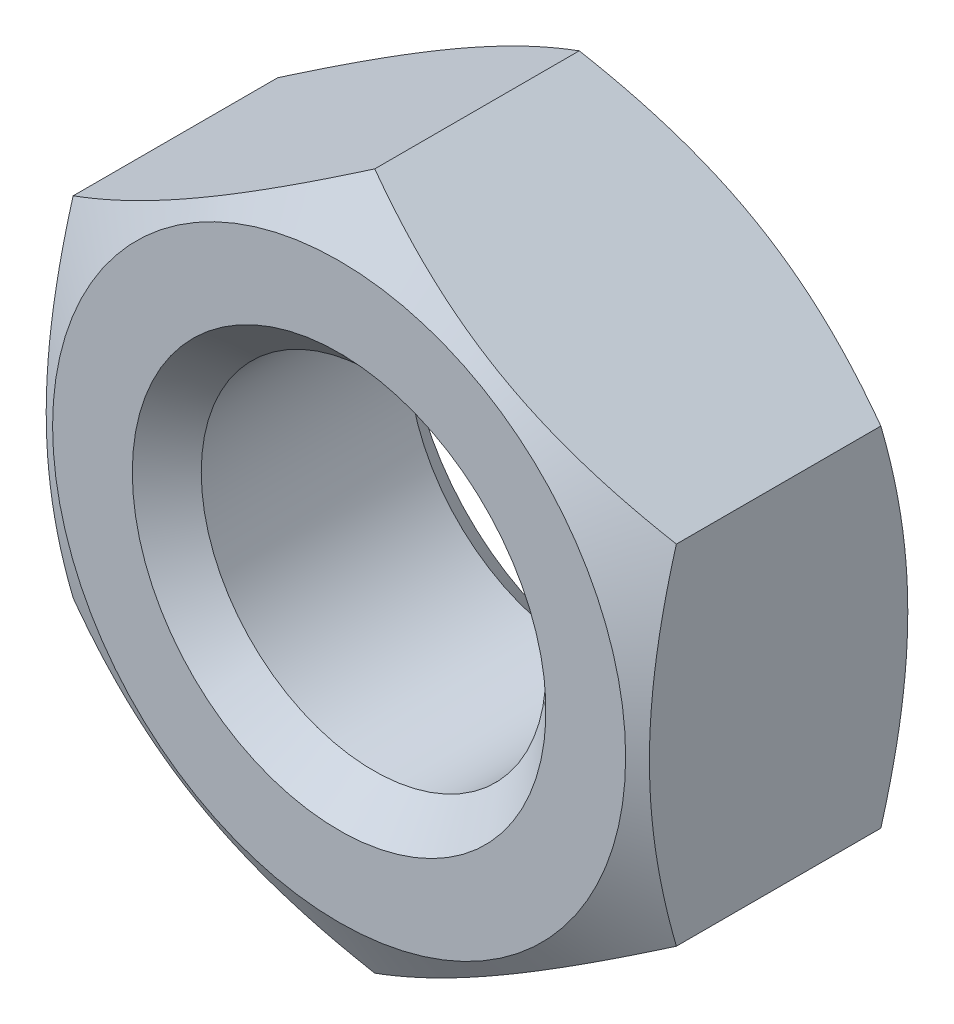
ISO-10303-21;
HEADER;
FILE_DESCRIPTION(('STEP AP214'),'2;1');
FILE_NAME('part.step','',(''),(''),'','','');
FILE_SCHEMA(('AUTOMOTIVE_DESIGN { 1 0 10303 214 1 1 1 1 }'));
ENDSEC;
DATA;
#1=APPLICATION_CONTEXT('core data for automotive mechanical design processes');
#2=APPLICATION_PROTOCOL_DEFINITION('international standard','automotive_design',2000,#1);
#3=PRODUCT_CONTEXT('',#1,'mechanical');
#4=PRODUCT('Part','Part','',(#3));
#5=PRODUCT_RELATED_PRODUCT_CATEGORY('part','',(#4));
#6=PRODUCT_DEFINITION_FORMATION('','',#4);
#7=PRODUCT_DEFINITION_CONTEXT('part definition',#1,'design');
#8=PRODUCT_DEFINITION('design','',#6,#7);
#9=PRODUCT_DEFINITION_SHAPE('','',#8);
#10=(LENGTH_UNIT() NAMED_UNIT(*) SI_UNIT(.MILLI.,.METRE.));
#11=(NAMED_UNIT(*) PLANE_ANGLE_UNIT() SI_UNIT($,.RADIAN.));
#12=(NAMED_UNIT(*) SI_UNIT($,.STERADIAN.) SOLID_ANGLE_UNIT());
#13=UNCERTAINTY_MEASURE_WITH_UNIT(LENGTH_MEASURE(1.E-05),#10,'distance_accuracy_value','');
#14=(GEOMETRIC_REPRESENTATION_CONTEXT(3) GLOBAL_UNCERTAINTY_ASSIGNED_CONTEXT((#13)) GLOBAL_UNIT_ASSIGNED_CONTEXT((#10,
#11,#12)) REPRESENTATION_CONTEXT('',''));
#15=CARTESIAN_POINT('',(0.,0.,0.));
#16=DIRECTION('',(0.,0.,1.));
#17=DIRECTION('',(1.,0.,0.));
#18=AXIS2_PLACEMENT_3D('',#15,#16,#17);
#19=CARTESIAN_POINT('',(0.,0.,0.));
#20=DIRECTION('',(0.,0.,-1.));
#21=DIRECTION('',(-0.999999999999908,0.,0.));
#22=AXIS2_PLACEMENT_3D('',#19,#20,#21);
#23=PLANE('',#22);
#24=CARTESIAN_POINT('',(0.,0.,0.));
#25=DIRECTION('',(0.,0.,-1.));
#26=DIRECTION('',(-0.999999999999908,0.,0.));
#27=AXIS2_PLACEMENT_3D('',#24,#25,#26);
#28=CIRCLE('',#27,2.4);
#29=CARTESIAN_POINT('',(-2.39999999999978,0.,0.));
#30=VERTEX_POINT('',#29);
#31=EDGE_CURVE('E136',#30,#30,#28,.T.);
#32=ORIENTED_EDGE('',*,*,#31,.T.);
#33=EDGE_LOOP('',(#32));
#34=FACE_BOUND('',#33,.T.);
#35=CARTESIAN_POINT('',(0.,0.,0.));
#36=DIRECTION('',(0.,0.,1.));
#37=DIRECTION('',(0.999999999999908,0.,0.));
#38=AXIS2_PLACEMENT_3D('',#35,#36,#37);
#39=CIRCLE('',#38,3.325);
#40=CARTESIAN_POINT('',(3.32499999999969,0.,0.));
#41=VERTEX_POINT('',#40);
#42=EDGE_CURVE('E257',#41,#41,#39,.T.);
#43=ORIENTED_EDGE('',*,*,#42,.T.);
#44=EDGE_LOOP('',(#43));
#45=FACE_BOUND('',#44,.T.);
#46=ADVANCED_FACE('F49',(#34,#45),#23,.F.);
#47=CARTESIAN_POINT('',(0.,8.18789480661053E-13,-3.19999999999997));
#48=DIRECTION('',(0.,0.,1.));
#49=DIRECTION('',(0.999999999999908,0.,0.));
#50=AXIS2_PLACEMENT_3D('',#47,#48,#49);
#51=PLANE('',#50);
#52=CARTESIAN_POINT('',(0.,8.18789480661053E-13,-3.19999999999997));
#53=DIRECTION('',(0.,0.,1.));
#54=DIRECTION('',(0.999999999999908,0.,0.));
#55=AXIS2_PLACEMENT_3D('',#52,#53,#54);
#56=CIRCLE('',#55,2.4);
#57=CARTESIAN_POINT('',(2.39999999999978,8.18789480661053E-13,-3.19999999999997));
#58=VERTEX_POINT('',#57);
#59=EDGE_CURVE('E14',#58,#58,#56,.T.);
#60=ORIENTED_EDGE('',*,*,#59,.T.);
#61=EDGE_LOOP('',(#60));
#62=FACE_BOUND('',#61,.T.);
#63=CARTESIAN_POINT('',(0.,8.18789480661053E-13,-3.19999999999997));
#64=DIRECTION('',(0.,0.,1.));
#65=DIRECTION('',(0.999999999999908,0.,0.));
#66=AXIS2_PLACEMENT_3D('',#63,#64,#65);
#67=CIRCLE('',#66,3.325);
#68=CARTESIAN_POINT('',(3.32499999999969,8.18789480661053E-13,-3.19999999999997));
#69=VERTEX_POINT('',#68);
#70=EDGE_CURVE('E256',#69,#69,#67,.T.);
#71=ORIENTED_EDGE('',*,*,#70,.F.);
#72=EDGE_LOOP('',(#71));
#73=FACE_BOUND('',#72,.T.);
#74=ADVANCED_FACE('F222',(#62,#73),#51,.F.);
#75=CARTESIAN_POINT('',(0.,8.18789480661053E-13,-3.19999999999997));
#76=DIRECTION('',(0.,0.,1.));
#77=DIRECTION('',(0.999999999999908,0.,0.));
#78=AXIS2_PLACEMENT_3D('',#75,#76,#77);
#79=CYLINDRICAL_SURFACE('',#78,2.);
#80=CARTESIAN_POINT('',(0.,-1.22124532708767E-12,-0.399999999999998));
#81=DIRECTION('',(0.,0.,-1.));
#82=DIRECTION('',(-0.999999999999908,0.,0.));
#83=AXIS2_PLACEMENT_3D('',#80,#81,#82);
#84=CIRCLE('',#83,2.);
#85=CARTESIAN_POINT('',(-1.99999999999982,-1.22124532708767E-12,-0.399999999999998));
#86=VERTEX_POINT('',#85);
#87=EDGE_CURVE('E57',#86,#86,#84,.F.);
#88=ORIENTED_EDGE('',*,*,#87,.T.);
#89=EDGE_LOOP('',(#88));
#90=FACE_BOUND('',#89,.T.);
#91=CARTESIAN_POINT('',(0.,6.10622663543836E-13,-2.79999999999998));
#92=DIRECTION('',(0.,0.,1.));
#93=DIRECTION('',(0.999999999999908,0.,0.));
#94=AXIS2_PLACEMENT_3D('',#91,#92,#93);
#95=CIRCLE('',#94,2.);
#96=CARTESIAN_POINT('',(1.99999999999982,6.10622663543836E-13,-2.79999999999998));
#97=VERTEX_POINT('',#96);
#98=EDGE_CURVE('E248',#97,#97,#95,.F.);
#99=ORIENTED_EDGE('',*,*,#98,.T.);
#100=EDGE_LOOP('',(#99));
#101=FACE_BOUND('',#100,.T.);
#102=ADVANCED_FACE('F219',(#90,#101),#79,.F.);
#103=CARTESIAN_POINT('',(0.,6.10622663543836E-13,-2.78635631172215));
#104=DIRECTION('',(0.,0.,1.));
#105=DIRECTION('',(0.999999999999908,0.,0.));
#106=AXIS2_PLACEMENT_3D('',#103,#104,#105);
#107=CONICAL_SURFACE('',#106,4.04145188432738,1.0471975511966);
#108=ORIENTED_EDGE('',*,*,#70,.T.);
#109=EDGE_LOOP('',(#108));
#110=FACE_BOUND('',#109,.T.);
#111=CARTESIAN_POINT('',(-0.000200000000005751,-4.04156735438062,-2.78628964219841));
#112=CARTESIAN_POINT('',(0.153607178452216,-3.95276673849745,-2.83757791390199));
#113=CARTESIAN_POINT('',(0.308742010834124,-3.86319960126091,-2.88422274907586));
#114=CARTESIAN_POINT('',(0.621698006576462,-3.68251437287448,-2.96564182735878));
#115=CARTESIAN_POINT('',(0.779524730787225,-3.59139307116614,-3.00038726730756));
#116=CARTESIAN_POINT('',(1.09322221037986,-3.41027974687918,-3.05447367570928));
#117=CARTESIAN_POINT('',(1.24904469916038,-3.32031559103583,-3.07417461663175));
#118=CARTESIAN_POINT('',(1.56142288720519,-3.13996396007946,-3.09769357015488));
#119=CARTESIAN_POINT('',(1.71797745103422,-3.04957714051028,-3.10153105834656));
#120=CARTESIAN_POINT('',(2.01050921992096,-2.88068384499694,-3.09354840101514));
#121=CARTESIAN_POINT('',(2.14653021245773,-2.80215208834006,-3.08368826882252));
#122=CARTESIAN_POINT('',(2.41768602028871,-2.64560020969628,-3.05243723599271));
#123=CARTESIAN_POINT('',(2.55281989768444,-2.56758062920532,-3.03103565960631));
#124=CARTESIAN_POINT('',(2.82453479240495,-2.41070596159563,-2.97753329501153));
#125=CARTESIAN_POINT('',(2.96108141927808,-2.33187072981343,-2.94520570844704));
#126=CARTESIAN_POINT('',(3.23213809294428,-2.1753760863067,-2.87183476908406));
#127=CARTESIAN_POINT('',(3.36665161246837,-2.09771466959999,-2.8308086563221));
#128=CARTESIAN_POINT('',(3.50020000000001,-2.02061047210925,-2.7862896421984));
#129=B_SPLINE_CURVE_WITH_KNOTS('',3,(#111,#112,#113,#114,#115,#116,#117,#118,#119,#120,#121,
#122,#123,#124,#125,#126,#127,#128),.UNSPECIFIED.,.F.,.F.,(4,2,2,2,2,2,2,2,4),(0.,
0.554793832886324,1.11092123814996,1.65328467083234,2.19498204478421,2.66665130850877,
3.13875761298283,3.62133612600526,4.10296698719206),.UNSPECIFIED.);
#130=CARTESIAN_POINT('',(0.,-4.04145188432678,-2.78635631172214));
#131=VERTEX_POINT('',#130);
#132=CARTESIAN_POINT('',(3.5,-2.02072594216308,-2.78635631172212));
#133=VERTEX_POINT('',#132);
#134=EDGE_CURVE('E260',#131,#133,#129,.T.);
#135=ORIENTED_EDGE('',*,*,#134,.F.);
#136=CARTESIAN_POINT('',(-3.50020000000001,-2.02061047210923,-2.7862896421984));
#137=CARTESIAN_POINT('',(-3.34639282154764,-2.10941108799218,-2.83757791390164));
#138=CARTESIAN_POINT('',(-3.19125798916569,-2.19897822522862,-2.88422274907545));
#139=CARTESIAN_POINT('',(-2.87830199342331,-2.37966345361501,-2.96564182735838));
#140=CARTESIAN_POINT('',(-2.72047526921254,-2.47078475532339,-3.00038726730722));
#141=CARTESIAN_POINT('',(-2.40677778961989,-2.65189807961036,-3.05447367570877));
#142=CARTESIAN_POINT('',(-2.25095530083936,-2.74186223545367,-3.07417461663101));
#143=CARTESIAN_POINT('',(-1.93857711279463,-2.92221386641008,-3.09769357015472));
#144=CARTESIAN_POINT('',(-1.7820225489657,-3.01260068597933,-3.1015310583472));
#145=CARTESIAN_POINT('',(-1.48949078007904,-3.18149398149261,-3.09354840101567));
#146=CARTESIAN_POINT('',(-1.35346978754226,-3.26002573814937,-3.08368826882234));
#147=CARTESIAN_POINT('',(-1.08231397971128,-3.41657761679308,-3.05243723599203));
#148=CARTESIAN_POINT('',(-0.947180102315549,-3.49459719728408,-3.03103565960582));
#149=CARTESIAN_POINT('',(-0.675465207594987,-3.6514718648938,-2.97753329501119));
#150=CARTESIAN_POINT('',(-0.538918580721815,-3.73030709667599,-2.94520570844663));
#151=CARTESIAN_POINT('',(-0.267861907055606,-3.8868017401828,-2.87183476908366));
#152=CARTESIAN_POINT('',(-0.133348387531548,-3.96446315688961,-2.83080865632177));
#153=CARTESIAN_POINT('',(0.000200000000005751,-4.04156735438062,-2.78628964219841));
#154=B_SPLINE_CURVE_WITH_KNOTS('',3,(#136,#137,#138,#139,#140,#141,#142,#143,#144,#145,#146,
#147,#148,#149,#150,#151,#152,#153),.UNSPECIFIED.,.F.,.F.,(4,2,2,2,2,2,2,2,4),(0.,
0.554793832886204,1.11092123814993,1.65328467083227,2.19498204478402,2.66665130850853,
3.13875761298261,3.62133612600516,4.10296698719193),.UNSPECIFIED.);
#155=CARTESIAN_POINT('',(-3.5,-2.02072594216307,-2.78635631172212));
#156=VERTEX_POINT('',#155);
#157=EDGE_CURVE('E205',#156,#131,#154,.T.);
#158=ORIENTED_EDGE('',*,*,#157,.F.);
#159=CARTESIAN_POINT('',(-3.5,-5.34526181714487,-1.43088568831283));
#160=CARTESIAN_POINT('',(-3.5,-5.19170051779117,-1.50503672966403));
#161=CARTESIAN_POINT('',(-3.5,-5.03777455935829,-1.57844634407758));
#162=CARTESIAN_POINT('',(-3.5,-4.72899608100103,-1.72335871364681));
#163=CARTESIAN_POINT('',(-3.5,-4.57414340475472,-1.79486113531656));
#164=CARTESIAN_POINT('',(-3.5,-4.2624708097439,-1.93591485469222));
#165=CARTESIAN_POINT('',(-3.5,-4.10564469538528,-2.00545251235748));
#166=CARTESIAN_POINT('',(-3.5,-3.79069830686184,-2.14152077221436));
#167=CARTESIAN_POINT('',(-3.5,-3.63257810118923,-2.20805153235156));
#168=CARTESIAN_POINT('',(-3.5,-3.31289445808477,-2.33806896187004));
#169=CARTESIAN_POINT('',(-3.5,-3.1513124255715,-2.40151016229672));
#170=CARTESIAN_POINT('',(-3.5,-2.8262375114074,-2.52338880679866));
#171=CARTESIAN_POINT('',(-3.5,-2.66274441881498,-2.58182569245878));
#172=CARTESIAN_POINT('',(-3.5,-2.3339277773035,-2.69211528383048));
#173=CARTESIAN_POINT('',(-3.5,-2.16860901385356,-2.74398211033475));
#174=CARTESIAN_POINT('',(-3.5,-1.8356219930784,-2.83943806104316));
#175=CARTESIAN_POINT('',(-3.5,-1.66795450109762,-2.88302981730834));
#176=CARTESIAN_POINT('',(-3.5,-1.33014983841182,-2.95981183318618));
#177=CARTESIAN_POINT('',(-3.5,-1.16001185355535,-2.99299857850902));
#178=CARTESIAN_POINT('',(-3.5,-0.817700379598249,-3.04672415153755));
#179=CARTESIAN_POINT('',(-3.5,-0.645526886105654,-3.06726295194796));
#180=CARTESIAN_POINT('',(-3.5,-0.301125491851443,-3.09387533047803));
#181=CARTESIAN_POINT('',(-3.5,-0.128904735017056,-3.10003901706232));
#182=CARTESIAN_POINT('',(-3.5,0.21539302145167,-3.09757992160363));
#183=CARTESIAN_POINT('',(-3.5,0.387470046531829,-3.08896090611416));
#184=CARTESIAN_POINT('',(-3.5,0.681759290685613,-3.06218285983281));
#185=CARTESIAN_POINT('',(-3.5,0.804297096459646,-3.04741535990064));
#186=CARTESIAN_POINT('',(-3.5,1.04841668941679,-3.01135199831462));
#187=CARTESIAN_POINT('',(-3.5,1.16999832090341,-2.99005509514569));
#188=CARTESIAN_POINT('',(-3.5,1.53321493371372,-2.91748915601702));
#189=CARTESIAN_POINT('',(-3.5,1.77313647937591,-2.85756389301242));
#190=CARTESIAN_POINT('',(-3.5,2.13211518992131,-2.75432847208893));
#191=CARTESIAN_POINT('',(-3.5,2.25304646048423,-2.71717057420928));
#192=CARTESIAN_POINT('',(-3.5,2.49364645990928,-2.6392078057206));
#193=CARTESIAN_POINT('',(-3.5,2.61331600013571,-2.59840546174206));
#194=CARTESIAN_POINT('',(-3.5,2.85089193463016,-2.51400044501985));
#195=CARTESIAN_POINT('',(-3.5,2.96880446832294,-2.47041487922007));
#196=CARTESIAN_POINT('',(-3.5,3.20371724855571,-2.38070481574431));
#197=CARTESIAN_POINT('',(-3.5,3.32071709950621,-2.3345792801404));
#198=CARTESIAN_POINT('',(-3.5,3.43729521794868,-2.28743504166289));
#199=B_SPLINE_CURVE_WITH_KNOTS('',3,(#159,#160,#161,#162,#163,#164,#165,#166,#167,#168,#169,
#170,#171,#172,#173,#174,#175,#176,#177,#178,#179,#180,#181,#182,#183,#184,#185,#186,#187,#188,
#189,#190,#191,#192,#193,#194,#195,#196,#197,#198),.UNSPECIFIED.,.F.,.F.,(4,2,2,2,2,2,2,2,2,2,2,
2,2,2,2,2,2,2,2,4),(0.,0.511587873670723,1.02326462328226,1.5378940301626,2.05249637322301,
2.57320277380441,3.0939672028071,3.61359266298198,4.1330525673414,4.6526877306207,
5.17232401531018,5.68869417196934,6.20493277981566,6.57502508718526,6.94517645928467,
7.68603507681531,8.0655389522863,8.44478173681004,8.82188382612641,9.19914117399197),.UNSPECIFIED.);
#200=CARTESIAN_POINT('',(-3.5,2.02072594216429,-2.78635631172217));
#201=VERTEX_POINT('',#200);
#202=EDGE_CURVE('E199',#201,#156,#199,.F.);
#203=ORIENTED_EDGE('',*,*,#202,.F.);
#204=CARTESIAN_POINT('',(0.000200000000005751,4.04156735438183,-2.78628964219844));
#205=CARTESIAN_POINT('',(-0.153607178452687,3.95276673849936,-2.83757791390157));
#206=CARTESIAN_POINT('',(-0.308742010834728,3.86319960126305,-2.8842227490753));
#207=CARTESIAN_POINT('',(-0.621698006577133,3.68251437287674,-2.96564182735813));
#208=CARTESIAN_POINT('',(-0.77952473078783,3.59139307116829,-3.00038726730697));
#209=CARTESIAN_POINT('',(-1.09322221038052,3.41027974688143,-3.05447367570859));
#210=CARTESIAN_POINT('',(-1.24904469916115,3.3203155910383,-3.0741746166309));
#211=CARTESIAN_POINT('',(-1.56142288720564,3.13996396008143,-3.09769357015439));
#212=CARTESIAN_POINT('',(-1.71797745103423,3.04957714051156,-3.10153105834658));
#213=CARTESIAN_POINT('',(-2.01050921992097,2.88068384499837,-3.0935484010151));
#214=CARTESIAN_POINT('',(-2.14653021245807,2.80215208834214,-3.08368826882202));
#215=CARTESIAN_POINT('',(-2.41768602028929,2.64560020969881,-3.05243723599191));
#216=CARTESIAN_POINT('',(-2.55281989768492,2.56758062920766,-3.03103565960564));
#217=CARTESIAN_POINT('',(-2.8245347924054,2.41070596159788,-2.97753329501096));
#218=CARTESIAN_POINT('',(-2.96108141927859,2.33187072981578,-2.9452057084464));
#219=CARTESIAN_POINT('',(-3.23213809294474,2.17537608630892,-2.87183476908351));
#220=CARTESIAN_POINT('',(-3.36665161246872,2.09771466960196,-2.8308086563217));
#221=CARTESIAN_POINT('',(-3.50020000000001,2.02061047211045,-2.78628964219844));
#222=B_SPLINE_CURVE_WITH_KNOTS('',3,(#204,#205,#206,#207,#208,#209,#210,#211,#212,#213,#214,
#215,#216,#217,#218,#219,#220,#221),.UNSPECIFIED.,.F.,.F.,(4,2,2,2,2,2,2,2,4),(0.,
0.554793832886193,1.11092123814985,1.6532846708322,2.19498204478398,2.6666513085085,
3.13875761298257,3.62133612600504,4.10296698719177),.UNSPECIFIED.);
#223=CARTESIAN_POINT('',(0.,4.04145188432799,-2.78635631172217));
#224=VERTEX_POINT('',#223);
#225=EDGE_CURVE('E103',#224,#201,#222,.T.);
#226=ORIENTED_EDGE('',*,*,#225,.F.);
#227=CARTESIAN_POINT('',(3.50020000000001,2.02061047211045,-2.78628964219844));
#228=CARTESIAN_POINT('',(3.34639282154758,2.10941108799332,-2.83757791390179));
#229=CARTESIAN_POINT('',(3.19125798916561,2.19897822522975,-2.88422274907556));
#230=CARTESIAN_POINT('',(2.87830199342326,2.3796634536161,-2.9656418273584));
#231=CARTESIAN_POINT('',(2.72047526921254,2.47078475532446,-3.00038726730719));
#232=CARTESIAN_POINT('',(2.40677778961993,2.6518980796114,-3.05447367570891));
#233=CARTESIAN_POINT('',(2.25095530083939,2.74186223545468,-3.07417461663136));
#234=CARTESIAN_POINT('',(1.93857711279466,2.92221386641117,-3.09769357015451));
#235=CARTESIAN_POINT('',(1.78202254896575,3.01260068598051,-3.10153105834623));
#236=CARTESIAN_POINT('',(1.489490780079,3.18149398149381,-3.09354840101481));
#237=CARTESIAN_POINT('',(1.35346978754214,3.26002573815054,-3.08368826882215));
#238=CARTESIAN_POINT('',(1.08231397971109,3.41657761679423,-3.05243723599234));
#239=CARTESIAN_POINT('',(0.947180102315384,3.49459719728524,-3.03103565960595));
#240=CARTESIAN_POINT('',(0.675465207594869,3.65147186489494,-2.97753329501118));
#241=CARTESIAN_POINT('',(0.538918580721722,3.7303070966771,-2.94520570844666));
#242=CARTESIAN_POINT('',(0.267861907055548,3.88680174018391,-2.87183476908376));
#243=CARTESIAN_POINT('',(0.1333483875315,3.96446315689074,-2.83080865632191));
#244=CARTESIAN_POINT('',(-0.000200000000005751,4.04156735438183,-2.78628964219844));
#245=B_SPLINE_CURVE_WITH_KNOTS('',3,(#227,#228,#229,#230,#231,#232,#233,#234,#235,#236,#237,
#238,#239,#240,#241,#242,#243,#244),.UNSPECIFIED.,.F.,.F.,(4,2,2,2,2,2,2,2,4),(0.,
0.554793832886237,1.11092123814981,1.65328467083216,2.19498204478399,2.66665130850856,
3.13875761298265,3.62133612600508,4.10296698719186),.UNSPECIFIED.);
#246=CARTESIAN_POINT('',(3.5,2.02072594216429,-2.78635631172217));
#247=VERTEX_POINT('',#246);
#248=EDGE_CURVE('E100',#247,#224,#245,.T.);
#249=ORIENTED_EDGE('',*,*,#248,.F.);
#250=CARTESIAN_POINT('',(3.5,-5.34526181714545,-1.43088568831283));
#251=CARTESIAN_POINT('',(3.5,-5.19170051779167,-1.50503672966389));
#252=CARTESIAN_POINT('',(3.5,-5.03777455935875,-1.57844634407739));
#253=CARTESIAN_POINT('',(3.5,-4.72899608100144,-1.72335871364659));
#254=CARTESIAN_POINT('',(3.5,-4.57414340475512,-1.79486113531637));
#255=CARTESIAN_POINT('',(3.5,-4.26247080974428,-1.93591485469206));
#256=CARTESIAN_POINT('',(3.5,-4.10564469538564,-2.00545251235732));
#257=CARTESIAN_POINT('',(3.5,-3.79069830686216,-2.14152077221422));
#258=CARTESIAN_POINT('',(3.5,-3.63257810118954,-2.20805153235143));
#259=CARTESIAN_POINT('',(3.5,-3.31289445808505,-2.33806896186993));
#260=CARTESIAN_POINT('',(3.5,-3.15131242557175,-2.40151016229662));
#261=CARTESIAN_POINT('',(3.5,-2.8262375114076,-2.52338880679859));
#262=CARTESIAN_POINT('',(3.5,-2.66274441881516,-2.58182569245872));
#263=CARTESIAN_POINT('',(3.5,-2.33392777730364,-2.69211528383044));
#264=CARTESIAN_POINT('',(3.5,-2.16860901385367,-2.74398211033472));
#265=CARTESIAN_POINT('',(3.5,-1.83562199307847,-2.83943806104315));
#266=CARTESIAN_POINT('',(3.5,-1.66795450109766,-2.88302981730834));
#267=CARTESIAN_POINT('',(3.5,-1.33014983841185,-2.95981183318618));
#268=CARTESIAN_POINT('',(3.5,-1.16001185355538,-2.99299857850902));
#269=CARTESIAN_POINT('',(3.5,-0.817700379598298,-3.04672415153754));
#270=CARTESIAN_POINT('',(3.5,-0.645526886105713,-3.06726295194795));
#271=CARTESIAN_POINT('',(3.5,-0.301125491851523,-3.09387533047802));
#272=CARTESIAN_POINT('',(3.5,-0.128904735017148,-3.10003901706232));
#273=CARTESIAN_POINT('',(3.5,0.215393021451554,-3.09757992160363));
#274=CARTESIAN_POINT('',(3.5,0.387470046531702,-3.08896090611416));
#275=CARTESIAN_POINT('',(3.5,0.681759290685433,-3.06218285983282));
#276=CARTESIAN_POINT('',(3.5,0.804297096459426,-3.04741535990067));
#277=CARTESIAN_POINT('',(3.5,1.04841668941649,-3.01135199831467));
#278=CARTESIAN_POINT('',(3.5,1.16999832090307,-2.99005509514576));
#279=CARTESIAN_POINT('',(3.5,1.53321493371326,-2.91748915601712));
#280=CARTESIAN_POINT('',(3.5,1.77313647937538,-2.85756389301255));
#281=CARTESIAN_POINT('',(3.5,2.13211518992066,-2.75432847208913));
#282=CARTESIAN_POINT('',(3.5,2.25304646048355,-2.7171705742095));
#283=CARTESIAN_POINT('',(3.5,2.49364645990852,-2.63920780572085));
#284=CARTESIAN_POINT('',(3.5,2.61331600013491,-2.59840546174233));
#285=CARTESIAN_POINT('',(3.5,2.8508919346293,-2.51400044502017));
#286=CARTESIAN_POINT('',(3.5,2.96880446832207,-2.47041487922044));
#287=CARTESIAN_POINT('',(3.5,3.20371724855473,-2.38070481574464));
#288=CARTESIAN_POINT('',(3.5,3.32071709950516,-2.33457928014065));
#289=CARTESIAN_POINT('',(3.5,3.4372952179475,-2.28743504166289));
#290=B_SPLINE_CURVE_WITH_KNOTS('',3,(#250,#251,#252,#253,#254,#255,#256,#257,#258,#259,#260,
#261,#262,#263,#264,#265,#266,#267,#268,#269,#270,#271,#272,#273,#274,#275,#276,#277,#278,#279,
#280,#281,#282,#283,#284,#285,#286,#287,#288,#289),.UNSPECIFIED.,.F.,.F.,(4,2,2,2,2,2,2,2,2,2,2,
2,2,2,2,2,2,2,2,4),(0.,0.51158787367077,1.02326462328236,1.53789403016275,2.05249637322322,
2.57320277380469,3.09396720280746,3.61359266298242,4.13305256734192,4.65268773062118,
5.17232401531064,5.68869417196976,6.20493277981605,6.57502508718552,6.94517645928481,
7.6860350768152,8.06553895228607,8.44478173680969,8.82188382612594,9.19914117399139),.UNSPECIFIED.);
#291=EDGE_CURVE('E72',#133,#247,#290,.T.);
#292=ORIENTED_EDGE('',*,*,#291,.F.);
#293=EDGE_LOOP('',(#135,#158,#203,#226,#249,#292));
#294=FACE_BOUND('',#293,.T.);
#295=ADVANCED_FACE('F101',(#110,#294),#107,.T.);
#296=CARTESIAN_POINT('',(0.,-4.0414518843261,-17.4835569799683));
#297=DIRECTION('',(0.499999999999954,-0.866025403784346,0.));
#298=DIRECTION('',(0.866025403784346,0.499999999999954,0.));
#299=AXIS2_PLACEMENT_3D('',#296,#297,#298);
#300=PLANE('',#299);
#301=DIRECTION('',(0.,0.,1.));
#302=VECTOR('',#301,1.);
#303=CARTESIAN_POINT('',(3.5,-2.02072594216302,-17.4835569799684));
#304=LINE('',#303,#302);
#305=CARTESIAN_POINT('',(3.5,-2.02072594216492,-0.413643688277738));
#306=VERTEX_POINT('',#305);
#307=EDGE_CURVE('E116',#133,#306,#304,.T.);
#308=ORIENTED_EDGE('',*,*,#307,.T.);
#309=CARTESIAN_POINT('',(3.50020000000001,-2.02061047211108,-0.413710357801466));
#310=CARTESIAN_POINT('',(3.34639282154686,-2.10941108799251,-0.362422086097561));
#311=CARTESIAN_POINT('',(3.19125798916465,-2.19897822522848,-0.31577725092367));
#312=CARTESIAN_POINT('',(2.87830199342223,-2.37966345361455,-0.234358172640841));
#313=CARTESIAN_POINT('',(2.72047526921169,-2.47078475532309,-0.199612732692173));
#314=CARTESIAN_POINT('',(2.40677778961905,-2.65189807960981,-0.145526324290252));
#315=CARTESIAN_POINT('',(2.25095530083832,-2.74186223545273,-0.125825383367499));
#316=CARTESIAN_POINT('',(1.93857711279409,-2.9222138664101,-0.102306429845186));
#317=CARTESIAN_POINT('',(1.78202254896586,-3.01260068598069,-0.0984689416546137));
#318=CARTESIAN_POINT('',(1.48949078007888,-3.18149398149388,-0.106451598985886));
#319=CARTESIAN_POINT('',(1.3534697875413,-3.26002573814956,-0.11631173117755));
#320=CARTESIAN_POINT('',(1.08231397970971,-3.41657761679252,-0.14756276400667));
#321=CARTESIAN_POINT('',(0.947180102314188,-3.49459719728386,-0.168964340393353));
#322=CARTESIAN_POINT('',(0.675465207593765,-3.65147186489369,-0.222466704988375));
#323=CARTESIAN_POINT('',(0.538918580720521,-3.73030709667564,-0.25479429155283));
#324=CARTESIAN_POINT('',(0.267861907054495,-3.88680174018271,-0.328165230915729));
#325=CARTESIAN_POINT('',(0.133348387530693,-3.96446315689,-0.369191343677651));
#326=CARTESIAN_POINT('',(-0.000200000000005751,-4.04156735438244,-0.413710357801466));
#327=B_SPLINE_CURVE_WITH_KNOTS('',3,(#309,#310,#311,#312,#313,#314,#315,#316,#317,#318,#319,
#320,#321,#322,#323,#324,#325,#326),.UNSPECIFIED.,.F.,.F.,(4,2,2,2,2,2,2,2,4),(0.,
0.554793832886304,1.11092123814965,1.65328467083194,2.19498204478387,2.66665130850861,
3.13875761298275,3.62133612600512,4.10296698719203),.UNSPECIFIED.);
#328=CARTESIAN_POINT('',(0.,-4.0414518843286,-0.413643688277738));
#329=VERTEX_POINT('',#328);
#330=EDGE_CURVE('E129',#306,#329,#327,.T.);
#331=ORIENTED_EDGE('',*,*,#330,.T.);
#332=DIRECTION('',(0.,0.,1.));
#333=VECTOR('',#332,1.);
#334=CARTESIAN_POINT('',(0.,-4.0414518843261,-17.4835569799683));
#335=LINE('',#334,#333);
#336=EDGE_CURVE('E137',#131,#329,#335,.T.);
#337=ORIENTED_EDGE('',*,*,#336,.F.);
#338=ORIENTED_EDGE('',*,*,#134,.T.);
#339=EDGE_LOOP('',(#308,#331,#337,#338));
#340=FACE_BOUND('',#339,.T.);
#341=ADVANCED_FACE('F139',(#340),#300,.T.);
#342=CARTESIAN_POINT('',(-3.5,-2.02072594216329,-17.4835569799684));
#343=DIRECTION('',(-0.499999999999954,-0.866025403784346,0.));
#344=DIRECTION('',(0.866025403784346,-0.499999999999954,0.));
#345=AXIS2_PLACEMENT_3D('',#342,#343,#344);
#346=PLANE('',#345);
#347=ORIENTED_EDGE('',*,*,#336,.T.);
#348=CARTESIAN_POINT('',(0.000200000000005751,-4.04156735438244,-0.413710357801466));
#349=CARTESIAN_POINT('',(-0.153607178452005,-3.95276673849877,-0.362422086098104));
#350=CARTESIAN_POINT('',(-0.308742010833846,-3.86319960126205,-0.31577725092433));
#351=CARTESIAN_POINT('',(-0.621698006576149,-3.68251437287551,-0.234358172641477));
#352=CARTESIAN_POINT('',(-0.779524730786942,-3.59139307116724,-0.199612732692672));
#353=CARTESIAN_POINT('',(-1.09322221037957,-3.41027974688024,-0.145526324290871));
#354=CARTESIAN_POINT('',(-1.24904469916005,-3.3203155910368,-0.125825383368359));
#355=CARTESIAN_POINT('',(-1.56142288720502,-3.13996396008062,-0.10230642984532));
#356=CARTESIAN_POINT('',(-1.71797745103424,-3.04957714051173,-0.0984689416537765));
#357=CARTESIAN_POINT('',(-2.01050921992097,-2.88068384499834,-0.106451598985148));
#358=CARTESIAN_POINT('',(-2.14653021245757,-2.8021520883412,-0.116311731177628));
#359=CARTESIAN_POINT('',(-2.41768602028842,-2.64560020969724,-0.147562764007306));
#360=CARTESIAN_POINT('',(-2.55281989768417,-2.56758062920637,-0.168964340393731));
#361=CARTESIAN_POINT('',(-2.82453479240466,-2.41070596159673,-0.222466704988505));
#362=CARTESIAN_POINT('',(-2.96108141927772,-2.33187072981448,-0.254794291552977));
#363=CARTESIAN_POINT('',(-3.23213809294394,-2.17537608630788,-0.32816523091589));
#364=CARTESIAN_POINT('',(-3.36665161246811,-2.09771466960134,-0.369191343677806));
#365=CARTESIAN_POINT('',(-3.50020000000001,-2.02061047211108,-0.413710357801466));
#366=B_SPLINE_CURVE_WITH_KNOTS('',3,(#348,#349,#350,#351,#352,#353,#354,#355,#356,#357,#358,
#359,#360,#361,#362,#363,#364,#365),.UNSPECIFIED.,.F.,.F.,(4,2,2,2,2,2,2,2,4),(0.,
0.554793832886348,1.11092123814999,1.65328467083242,2.19498204478435,2.66665130850887,
3.13875761298287,3.6213361260052,4.10296698719191),.UNSPECIFIED.);
#367=CARTESIAN_POINT('',(-3.5,-2.02072594216492,-0.413643688277738));
#368=VERTEX_POINT('',#367);
#369=EDGE_CURVE('E64',#329,#368,#366,.T.);
#370=ORIENTED_EDGE('',*,*,#369,.T.);
#371=DIRECTION('',(0.,0.,1.));
#372=VECTOR('',#371,1.);
#373=CARTESIAN_POINT('',(-3.5,-2.02072594216329,-17.4835569799684));
#374=LINE('',#373,#372);
#375=EDGE_CURVE('E271',#156,#368,#374,.T.);
#376=ORIENTED_EDGE('',*,*,#375,.F.);
#377=ORIENTED_EDGE('',*,*,#157,.T.);
#378=EDGE_LOOP('',(#347,#370,#376,#377));
#379=FACE_BOUND('',#378,.T.);
#380=ADVANCED_FACE('F213',(#379),#346,.T.);
#381=CARTESIAN_POINT('',(-3.5,2.02072594216408,-17.4835569799684));
#382=DIRECTION('',(-0.999999999999908,0.,0.));
#383=DIRECTION('',(0.,-0.999999999999908,0.));
#384=AXIS2_PLACEMENT_3D('',#381,#382,#383);
#385=PLANE('',#384);
#386=ORIENTED_EDGE('',*,*,#375,.T.);
#387=CARTESIAN_POINT('',(-3.5,-5.34526181714602,-1.76911431168768));
#388=CARTESIAN_POINT('',(-3.5,-5.19170051779236,-1.69496327033632));
#389=CARTESIAN_POINT('',(-3.5,-5.03777455935947,-1.62155365592269));
#390=CARTESIAN_POINT('',(-3.5,-4.72899608100217,-1.47664128635338));
#391=CARTESIAN_POINT('',(-3.5,-4.57414340475582,-1.40513886468363));
#392=CARTESIAN_POINT('',(-3.5,-4.26247080974496,-1.26408514530796));
#393=CARTESIAN_POINT('',(-3.5,-4.10564469538635,-1.1945474876427));
#394=CARTESIAN_POINT('',(-3.5,-3.79069830686289,-1.0584792277858));
#395=CARTESIAN_POINT('',(-3.5,-3.63257810119028,-0.991948467648602));
#396=CARTESIAN_POINT('',(-3.5,-3.3128944580858,-0.861931038130102));
#397=CARTESIAN_POINT('',(-3.5,-3.15131242557251,-0.798489837703405));
#398=CARTESIAN_POINT('',(-3.5,-2.82623751140839,-0.676611193201458));
#399=CARTESIAN_POINT('',(-3.5,-2.66274441881595,-0.618174307541358));
#400=CARTESIAN_POINT('',(-3.5,-2.33392777730445,-0.507884716169561));
#401=CARTESIAN_POINT('',(-3.5,-2.16860901385451,-0.456017889665179));
#402=CARTESIAN_POINT('',(-3.5,-1.83562199307921,-0.360561938957003));
#403=CARTESIAN_POINT('',(-3.5,-1.6679545010983,-0.316970182692167));
#404=CARTESIAN_POINT('',(-3.5,-1.33014983841247,-0.240188166814311));
#405=CARTESIAN_POINT('',(-3.5,-1.1600118535561,-0.207001421491101));
#406=CARTESIAN_POINT('',(-3.5,-0.817700379599148,-0.153275848462349));
#407=CARTESIAN_POINT('',(-3.5,-0.64552688610659,-0.13273704805208));
#408=CARTESIAN_POINT('',(-3.5,-0.301125491852459,-0.106124669521939));
#409=CARTESIAN_POINT('',(-3.5,-0.128904735018117,-0.0999609829374305));
#410=CARTESIAN_POINT('',(-3.5,0.215393021450493,-0.102420078396557));
#411=CARTESIAN_POINT('',(-3.5,0.387470046530582,-0.111039093886675));
#412=CARTESIAN_POINT('',(-3.5,0.681759290684307,-0.137817140167774));
#413=CARTESIAN_POINT('',(-3.5,0.804297096458319,-0.15258464009943));
#414=CARTESIAN_POINT('',(-3.5,1.04841668941534,-0.188648001685029));
#415=CARTESIAN_POINT('',(-3.5,1.16999832090186,-0.209944904854045));
#416=CARTESIAN_POINT('',(-3.5,1.53321493371186,-0.282510843982804));
#417=CARTESIAN_POINT('',(-3.5,1.77313647937386,-0.342436106987215));
#418=CARTESIAN_POINT('',(-3.5,2.13211518991895,-0.445671527910502));
#419=CARTESIAN_POINT('',(-3.5,2.25304646048175,-0.482829425790096));
#420=CARTESIAN_POINT('',(-3.5,2.49364645990656,-0.560792194278677));
#421=CARTESIAN_POINT('',(-3.5,2.61331600013287,-0.601594538257177));
#422=CARTESIAN_POINT('',(-3.5,2.85089193462717,-0.685999554979226));
#423=CARTESIAN_POINT('',(-3.5,2.96880446831992,-0.729585120778884));
#424=CARTESIAN_POINT('',(-3.5,3.20371724855245,-0.819295184254759));
#425=CARTESIAN_POINT('',(-3.5,3.32071709950277,-0.865420719858908));
#426=CARTESIAN_POINT('',(-3.5,3.43729521794489,-0.912564958337074));
#427=B_SPLINE_CURVE_WITH_KNOTS('',3,(#387,#388,#389,#390,#391,#392,#393,#394,#395,#396,#397,
#398,#399,#400,#401,#402,#403,#404,#405,#406,#407,#408,#409,#410,#411,#412,#413,#414,#415,#416,
#417,#418,#419,#420,#421,#422,#423,#424,#425,#426),.UNSPECIFIED.,.F.,.F.,(4,2,2,2,2,2,2,2,2,2,2,
2,2,2,2,2,2,2,2,4),(0.,0.511587873670839,1.02326462328248,1.53789403016283,2.05249637322326,
2.57320277380472,3.09396720280744,3.61359266298242,4.13305256734198,4.65268773062118,
5.1723240153105,5.68869417196951,6.20493277981575,6.57502508718512,6.94517645928426,
7.68603507681424,8.06553895228484,8.44478173680822,8.82188382612434,9.19914117398964),.UNSPECIFIED.);
#428=CARTESIAN_POINT('',(-3.5,2.02072594216247,-0.413643688277829));
#429=VERTEX_POINT('',#428);
#430=EDGE_CURVE('E162',#368,#429,#427,.T.);
#431=ORIENTED_EDGE('',*,*,#430,.T.);
#432=DIRECTION('',(0.,0.,1.));
#433=VECTOR('',#432,1.);
#434=CARTESIAN_POINT('',(-3.5,2.02072594216408,-17.4835569799684));
#435=LINE('',#434,#433);
#436=EDGE_CURVE('E123',#201,#429,#435,.T.);
#437=ORIENTED_EDGE('',*,*,#436,.F.);
#438=ORIENTED_EDGE('',*,*,#202,.T.);
#439=EDGE_LOOP('',(#386,#431,#437,#438));
#440=FACE_BOUND('',#439,.T.);
#441=ADVANCED_FACE('F210',(#440),#385,.T.);
#442=CARTESIAN_POINT('',(0.,4.04145188432867,-17.4835569799684));
#443=DIRECTION('',(-0.499999999999954,0.866025403784346,0.));
#444=DIRECTION('',(-0.866025403784346,-0.499999999999954,0.));
#445=AXIS2_PLACEMENT_3D('',#442,#443,#444);
#446=PLANE('',#445);
#447=ORIENTED_EDGE('',*,*,#436,.T.);
#448=CARTESIAN_POINT('',(-3.50020000000001,2.02061047210864,-0.413710357801557));
#449=CARTESIAN_POINT('',(-3.34639282154822,2.10941108799282,-0.362422086098624));
#450=CARTESIAN_POINT('',(-3.19125798916645,2.19897822522969,-0.315777250925008));
#451=CARTESIAN_POINT('',(-2.87830199342419,2.37966345361631,-0.234358172642268));
#452=CARTESIAN_POINT('',(-2.72047526921336,2.47078475532449,-0.199612732693419));
#453=CARTESIAN_POINT('',(-2.40677778962078,2.65189807961157,-0.145526324291688));
#454=CARTESIAN_POINT('',(-2.25095530084038,2.74186223545516,-0.125825383369287));
#455=CARTESIAN_POINT('',(-1.93857711279522,2.92221386641096,-0.102306429846023));
#456=CARTESIAN_POINT('',(-1.78202254896571,3.01260068597931,-0.0984689416541417));
#457=CARTESIAN_POINT('',(-1.48949078007908,3.18149398149275,-0.106451598985562));
#458=CARTESIAN_POINT('',(-1.35346978754277,3.26002573815035,-0.11631173117834));
#459=CARTESIAN_POINT('',(-1.08231397971214,3.41657761679463,-0.147562764008218));
#460=CARTESIAN_POINT('',(-0.947180102316297,3.49459719728536,-0.168964340394546));
#461=CARTESIAN_POINT('',(-0.675465207595776,3.65147186489494,-0.222466704989258));
#462=CARTESIAN_POINT('',(-0.53891858072276,3.73030709667726,-0.25479429155377));
#463=CARTESIAN_POINT('',(-0.267861907056492,3.88680174018378,-0.328165230916591));
#464=CARTESIAN_POINT('',(-0.133348387532221,3.96446315689017,-0.369191343678375));
#465=CARTESIAN_POINT('',(0.000200000000005751,4.04156735437999,-0.413710357801669));
#466=B_SPLINE_CURVE_WITH_KNOTS('',3,(#448,#449,#450,#451,#452,#453,#454,#455,#456,#457,#458,
#459,#460,#461,#462,#463,#464,#465),.UNSPECIFIED.,.F.,.F.,(4,2,2,2,2,2,2,2,4),(0.,
0.554793832886246,1.11092123814989,1.65328467083231,2.19498204478419,2.66665130850865,
3.13875761298265,3.62133612600498,4.10296698719162),.UNSPECIFIED.);
#467=CARTESIAN_POINT('',(0.,4.04145188432616,-0.413643688277948));
#468=VERTEX_POINT('',#467);
#469=EDGE_CURVE('E168',#429,#468,#466,.T.);
#470=ORIENTED_EDGE('',*,*,#469,.T.);
#471=DIRECTION('',(0.,0.,1.));
#472=VECTOR('',#471,1.);
#473=CARTESIAN_POINT('',(0.,4.04145188432867,-17.4835569799684));
#474=LINE('',#473,#472);
#475=EDGE_CURVE('E121',#224,#468,#474,.T.);
#476=ORIENTED_EDGE('',*,*,#475,.F.);
#477=ORIENTED_EDGE('',*,*,#225,.T.);
#478=EDGE_LOOP('',(#447,#470,#476,#477));
#479=FACE_BOUND('',#478,.T.);
#480=ADVANCED_FACE('F184',(#479),#446,.T.);
#481=CARTESIAN_POINT('',(3.5,2.02072594216436,-17.4835569799684));
#482=DIRECTION('',(0.499999999999954,0.866025403784346,0.));
#483=DIRECTION('',(-0.866025403784346,0.499999999999954,0.));
#484=AXIS2_PLACEMENT_3D('',#481,#482,#483);
#485=PLANE('',#484);
#486=ORIENTED_EDGE('',*,*,#475,.T.);
#487=CARTESIAN_POINT('',(-0.000200000000005751,4.04156735437999,-0.413710357801676));
#488=CARTESIAN_POINT('',(0.153607178453007,3.9527667384982,-0.362422086098281));
#489=CARTESIAN_POINT('',(0.308742010835156,3.86319960126212,-0.31577725092454));
#490=CARTESIAN_POINT('',(0.62169800657756,3.682514372876,-0.234358172641783));
#491=CARTESIAN_POINT('',(0.779524730788146,3.59139307116751,-0.19961273269304));
#492=CARTESIAN_POINT('',(1.09322221038077,3.41027974688072,-0.145526324291279));
#493=CARTESIAN_POINT('',(1.24904469916144,3.3203155910377,-0.12582538336875));
#494=CARTESIAN_POINT('',(1.56142288720578,3.1399639600806,-0.102306429845897));
#495=CARTESIAN_POINT('',(1.71797745103419,3.04957714051038,-0.0984689416545571));
#496=CARTESIAN_POINT('',(2.01050921992104,2.88068384499719,-0.106451598985936));
#497=CARTESIAN_POINT('',(2.14653021245839,2.80215208834123,-0.116311731178274));
#498=CARTESIAN_POINT('',(2.41768602028981,2.64560020969807,-0.14756276400786));
#499=CARTESIAN_POINT('',(2.55281989768539,2.56758062920682,-0.168964340394336));
#500=CARTESIAN_POINT('',(2.82453479240586,2.41070596159702,-0.222466704989217));
#501=CARTESIAN_POINT('',(2.96108141927908,2.33187072981501,-0.254794291553745));
#502=CARTESIAN_POINT('',(3.23213809294516,2.17537608630799,-0.328165230916545));
#503=CARTESIAN_POINT('',(3.36665161246904,2.09771466960079,-0.369191343678293));
#504=CARTESIAN_POINT('',(3.50020000000001,2.02061047210864,-0.413710357801557));
#505=B_SPLINE_CURVE_WITH_KNOTS('',3,(#487,#488,#489,#490,#491,#492,#493,#494,#495,#496,#497,
#498,#499,#500,#501,#502,#503,#504),.UNSPECIFIED.,.F.,.F.,(4,2,2,2,2,2,2,2,4),(0.,
0.554793832886164,1.11092123814958,1.65328467083186,2.19498204478368,2.66665130850833,
3.13875761298247,3.62133612600489,4.10296698719171),.UNSPECIFIED.);
#506=CARTESIAN_POINT('',(3.5,2.02072594216247,-0.413643688277829));
#507=VERTEX_POINT('',#506);
#508=EDGE_CURVE('E120',#468,#507,#505,.T.);
#509=ORIENTED_EDGE('',*,*,#508,.T.);
#510=DIRECTION('',(0.,0.,1.));
#511=VECTOR('',#510,1.);
#512=CARTESIAN_POINT('',(3.5,2.02072594216436,-17.4835569799684));
#513=LINE('',#512,#511);
#514=EDGE_CURVE('E114',#247,#507,#513,.T.);
#515=ORIENTED_EDGE('',*,*,#514,.F.);
#516=ORIENTED_EDGE('',*,*,#248,.T.);
#517=EDGE_LOOP('',(#486,#509,#515,#516));
#518=FACE_BOUND('',#517,.T.);
#519=ADVANCED_FACE('F119',(#518),#485,.T.);
#520=CARTESIAN_POINT('',(3.5,-2.02072594216302,-17.4835569799684));
#521=DIRECTION('',(0.999999999999908,0.,0.));
#522=DIRECTION('',(0.,0.999999999999908,0.));
#523=AXIS2_PLACEMENT_3D('',#520,#521,#522);
#524=PLANE('',#523);
#525=ORIENTED_EDGE('',*,*,#514,.T.);
#526=CARTESIAN_POINT('',(3.5,-5.34526181714655,-1.76911431168768));
#527=CARTESIAN_POINT('',(3.5,-5.1917005177928,-1.69496327033645));
#528=CARTESIAN_POINT('',(3.5,-5.03777455935988,-1.62155365592286));
#529=CARTESIAN_POINT('',(3.5,-4.72899608100252,-1.47664128635357));
#530=CARTESIAN_POINT('',(3.5,-4.57414340475616,-1.40513886468379));
#531=CARTESIAN_POINT('',(3.5,-4.26247080974527,-1.2640851453081));
#532=CARTESIAN_POINT('',(3.5,-4.10564469538663,-1.19454748764282));
#533=CARTESIAN_POINT('',(3.5,-3.79069830686314,-1.05847922778591));
#534=CARTESIAN_POINT('',(3.5,-3.6325781011905,-0.991948467648696));
#535=CARTESIAN_POINT('',(3.5,-3.31289445808599,-0.861931038130177));
#536=CARTESIAN_POINT('',(3.5,-3.15131242557268,-0.798489837703471));
#537=CARTESIAN_POINT('',(3.5,-2.82623751140852,-0.676611193201508));
#538=CARTESIAN_POINT('',(3.5,-2.66274441881607,-0.6181743075414));
#539=CARTESIAN_POINT('',(3.5,-2.33392777730454,-0.507884716169589));
#540=CARTESIAN_POINT('',(3.5,-2.16860901385458,-0.456017889665201));
#541=CARTESIAN_POINT('',(3.5,-1.83562199307924,-0.360561938957013));
#542=CARTESIAN_POINT('',(3.5,-1.66795450109832,-0.316970182692171));
#543=CARTESIAN_POINT('',(3.5,-1.33014983841247,-0.240188166814311));
#544=CARTESIAN_POINT('',(3.5,-1.1600118535561,-0.207001421491101));
#545=CARTESIAN_POINT('',(3.5,-0.81770037959915,-0.153275848462349));
#546=CARTESIAN_POINT('',(3.5,-0.645526886106592,-0.13273704805208));
#547=CARTESIAN_POINT('',(3.5,-0.301125491852462,-0.106124669521939));
#548=CARTESIAN_POINT('',(3.5,-0.128904735018119,-0.0999609829374299));
#549=CARTESIAN_POINT('',(3.5,0.215393021450493,-0.102420078396556));
#550=CARTESIAN_POINT('',(3.5,0.387470046530581,-0.111039093886675));
#551=CARTESIAN_POINT('',(3.5,0.681759290684337,-0.137817140167777));
#552=CARTESIAN_POINT('',(3.5,0.804297096458379,-0.152584640099437));
#553=CARTESIAN_POINT('',(3.5,1.04841668941546,-0.188648001685048));
#554=CARTESIAN_POINT('',(3.5,1.169998320902,-0.209944904854071));
#555=CARTESIAN_POINT('',(3.5,1.53321493371209,-0.282510843982856));
#556=CARTESIAN_POINT('',(3.5,1.77313647937415,-0.342436106987287));
#557=CARTESIAN_POINT('',(3.5,2.13211518991932,-0.445671527910613));
#558=CARTESIAN_POINT('',(3.5,2.25304646048215,-0.482829425790222));
#559=CARTESIAN_POINT('',(3.5,2.49364645990702,-0.560792194278826));
#560=CARTESIAN_POINT('',(3.5,2.61331600013336,-0.601594538257335));
#561=CARTESIAN_POINT('',(3.5,2.8508919346277,-0.685999554979427));
#562=CARTESIAN_POINT('',(3.5,2.96880446832047,-0.729585120779118));
#563=CARTESIAN_POINT('',(3.5,3.20371724855307,-0.819295184254969));
#564=CARTESIAN_POINT('',(3.5,3.32071709950344,-0.86542071985906));
#565=CARTESIAN_POINT('',(3.5,3.43729521794565,-0.912564958337067));
#566=B_SPLINE_CURVE_WITH_KNOTS('',3,(#526,#527,#528,#529,#530,#531,#532,#533,#534,#535,#536,
#537,#538,#539,#540,#541,#542,#543,#544,#545,#546,#547,#548,#549,#550,#551,#552,#553,#554,#555,
#556,#557,#558,#559,#560,#561,#562,#563,#564,#565),.UNSPECIFIED.,.F.,.F.,(4,2,2,2,2,2,2,2,2,2,2,
2,2,2,2,2,2,2,2,4),(0.,0.511587873670899,1.0232646232826,1.53789403016302,2.05249637322352,
2.57320277380503,3.09396720280781,3.61359266298284,4.13305256734246,4.65268773062165,
5.17232401531098,5.68869417196999,6.20493277981623,6.57502508718568,6.94517645928491,
7.68603507681507,8.06553895228576,8.44478173680923,8.82188382612544,9.19914117399082),.UNSPECIFIED.);
#567=EDGE_CURVE('E125',#507,#306,#566,.F.);
#568=ORIENTED_EDGE('',*,*,#567,.T.);
#569=ORIENTED_EDGE('',*,*,#307,.F.);
#570=ORIENTED_EDGE('',*,*,#291,.T.);
#571=EDGE_LOOP('',(#525,#568,#569,#570));
#572=FACE_BOUND('',#571,.T.);
#573=ADVANCED_FACE('F112',(#572),#524,.T.);
#574=CARTESIAN_POINT('',(0.,0.,0.));
#575=DIRECTION('',(0.,0.,-1.));
#576=DIRECTION('',(-0.999999999999908,0.,0.));
#577=AXIS2_PLACEMENT_3D('',#574,#575,#576);
#578=CONICAL_SURFACE('',#577,3.325,1.0471975511966);
#579=ORIENTED_EDGE('',*,*,#508,.F.);
#580=ORIENTED_EDGE('',*,*,#469,.F.);
#581=ORIENTED_EDGE('',*,*,#430,.F.);
#582=ORIENTED_EDGE('',*,*,#369,.F.);
#583=ORIENTED_EDGE('',*,*,#330,.F.);
#584=ORIENTED_EDGE('',*,*,#567,.F.);
#585=EDGE_LOOP('',(#579,#580,#581,#582,#583,#584));
#586=FACE_BOUND('',#585,.T.);
#587=ORIENTED_EDGE('',*,*,#42,.F.);
#588=EDGE_LOOP('',(#587));
#589=FACE_BOUND('',#588,.T.);
#590=ADVANCED_FACE('F143',(#586,#589),#578,.T.);
#591=CARTESIAN_POINT('',(0.,0.,0.));
#592=DIRECTION('',(0.,0.,1.));
#593=DIRECTION('',(0.999999999999908,0.,0.));
#594=AXIS2_PLACEMENT_3D('',#591,#592,#593);
#595=CONICAL_SURFACE('',#594,2.4,0.785398163397447);
#596=ORIENTED_EDGE('',*,*,#87,.F.);
#597=EDGE_LOOP('',(#596));
#598=FACE_BOUND('',#597,.T.);
#599=ORIENTED_EDGE('',*,*,#31,.F.);
#600=EDGE_LOOP('',(#599));
#601=FACE_BOUND('',#600,.T.);
#602=ADVANCED_FACE('F147',(#598,#601),#595,.F.);
#603=CARTESIAN_POINT('',(0.,8.18789480661053E-13,-3.19999999999997));
#604=DIRECTION('',(0.,0.,-1.));
#605=DIRECTION('',(-0.999999999999908,0.,0.));
#606=AXIS2_PLACEMENT_3D('',#603,#604,#605);
#607=CONICAL_SURFACE('',#606,2.4,0.785398163397446);
#608=ORIENTED_EDGE('',*,*,#98,.F.);
#609=EDGE_LOOP('',(#608));
#610=FACE_BOUND('',#609,.T.);
#611=ORIENTED_EDGE('',*,*,#59,.F.);
#612=EDGE_LOOP('',(#611));
#613=FACE_BOUND('',#612,.T.);
#614=ADVANCED_FACE('F51',(#610,#613),#607,.F.);
#615=CLOSED_SHELL('',(#46,#74,#102,#295,#341,#380,#441,#480,#519,#573,#590,#602,#614));
#616=MANIFOLD_SOLID_BREP('B2',#615);
#617=ADVANCED_BREP_SHAPE_REPRESENTATION('',(#18,#616),#14);
#618=SHAPE_DEFINITION_REPRESENTATION(#9,#617);
ENDSEC;
END-ISO-10303-21;
